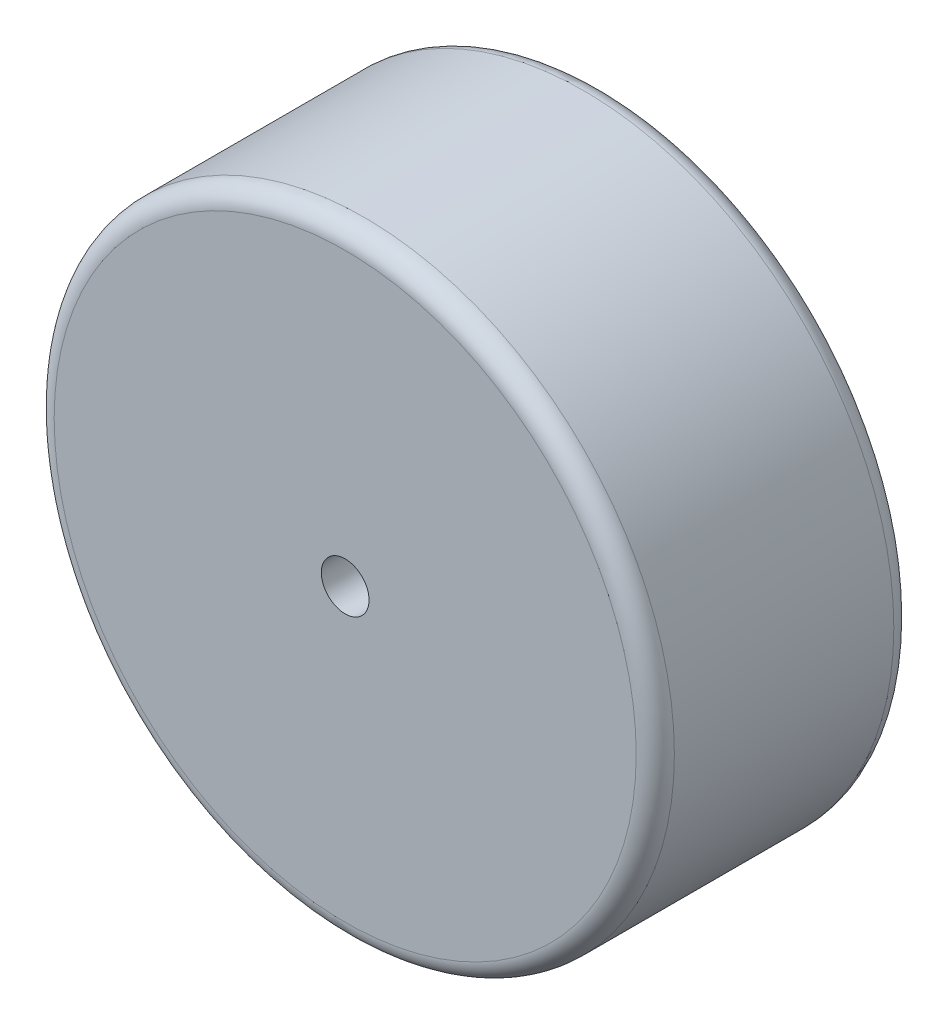
ISO-10303-21;
HEADER;
FILE_DESCRIPTION(('STEP AP214'),'2;1');
FILE_NAME('part.step','',(''),(''),'','','');
FILE_SCHEMA(('AUTOMOTIVE_DESIGN { 1 0 10303 214 1 1 1 1 }'));
ENDSEC;
DATA;
#1=APPLICATION_CONTEXT('core data for automotive mechanical design processes');
#2=APPLICATION_PROTOCOL_DEFINITION('international standard','automotive_design',2000,#1);
#3=PRODUCT_CONTEXT('',#1,'mechanical');
#4=PRODUCT('Part','Part','',(#3));
#5=PRODUCT_RELATED_PRODUCT_CATEGORY('part','',(#4));
#6=PRODUCT_DEFINITION_FORMATION('','',#4);
#7=PRODUCT_DEFINITION_CONTEXT('part definition',#1,'design');
#8=PRODUCT_DEFINITION('design','',#6,#7);
#9=PRODUCT_DEFINITION_SHAPE('','',#8);
#10=(LENGTH_UNIT() NAMED_UNIT(*) SI_UNIT(.MILLI.,.METRE.));
#11=(NAMED_UNIT(*) PLANE_ANGLE_UNIT() SI_UNIT($,.RADIAN.));
#12=(NAMED_UNIT(*) SI_UNIT($,.STERADIAN.) SOLID_ANGLE_UNIT());
#13=UNCERTAINTY_MEASURE_WITH_UNIT(LENGTH_MEASURE(1.E-05),#10,'distance_accuracy_value','');
#14=(GEOMETRIC_REPRESENTATION_CONTEXT(3) GLOBAL_UNCERTAINTY_ASSIGNED_CONTEXT((#13)) GLOBAL_UNIT_ASSIGNED_CONTEXT((#10,
#11,#12)) REPRESENTATION_CONTEXT('',''));
#15=CARTESIAN_POINT('',(0.,0.,0.));
#16=DIRECTION('',(0.,0.,1.));
#17=DIRECTION('',(1.,0.,0.));
#18=AXIS2_PLACEMENT_3D('',#15,#16,#17);
#19=CARTESIAN_POINT('',(0.,0.,13.5));
#20=DIRECTION('',(0.,0.,-1.));
#21=DIRECTION('',(-1.,0.,0.));
#22=AXIS2_PLACEMENT_3D('',#19,#20,#21);
#23=CYLINDRICAL_SURFACE('',#22,32.5);
#24=CARTESIAN_POINT('',(0.,0.,11.5));
#25=DIRECTION('',(0.,0.,1.));
#26=DIRECTION('',(1.,0.,0.));
#27=AXIS2_PLACEMENT_3D('',#24,#25,#26);
#28=CIRCLE('',#27,32.5);
#29=CARTESIAN_POINT('',(32.5,0.,11.5));
#30=VERTEX_POINT('',#29);
#31=EDGE_CURVE('E41',#30,#30,#28,.F.);
#32=ORIENTED_EDGE('',*,*,#31,.T.);
#33=EDGE_LOOP('',(#32));
#34=FACE_BOUND('',#33,.T.);
#35=CARTESIAN_POINT('',(0.,0.,-11.5));
#36=DIRECTION('',(0.,0.,1.));
#37=DIRECTION('',(1.,0.,0.));
#38=AXIS2_PLACEMENT_3D('',#35,#36,#37);
#39=CIRCLE('',#38,32.5);
#40=CARTESIAN_POINT('',(32.5,0.,-11.5));
#41=VERTEX_POINT('',#40);
#42=EDGE_CURVE('E45',#41,#41,#39,.T.);
#43=ORIENTED_EDGE('',*,*,#42,.T.);
#44=EDGE_LOOP('',(#43));
#45=FACE_BOUND('',#44,.T.);
#46=ADVANCED_FACE('F34',(#34,#45),#23,.T.);
#47=CARTESIAN_POINT('',(0.,0.,13.5));
#48=DIRECTION('',(0.,0.,1.));
#49=DIRECTION('',(1.,0.,0.));
#50=AXIS2_PLACEMENT_3D('',#47,#48,#49);
#51=PLANE('',#50);
#52=CARTESIAN_POINT('',(0.,0.,13.5));
#53=DIRECTION('',(0.,0.,1.));
#54=DIRECTION('',(1.,0.,0.));
#55=AXIS2_PLACEMENT_3D('',#52,#53,#54);
#56=CIRCLE('',#55,2.5);
#57=CARTESIAN_POINT('',(2.5,0.,13.5));
#58=VERTEX_POINT('',#57);
#59=EDGE_CURVE('E55',#58,#58,#56,.T.);
#60=ORIENTED_EDGE('',*,*,#59,.F.);
#61=EDGE_LOOP('',(#60));
#62=FACE_BOUND('',#61,.T.);
#63=CARTESIAN_POINT('',(0.,0.,13.5));
#64=DIRECTION('',(0.,0.,1.));
#65=DIRECTION('',(1.,0.,0.));
#66=AXIS2_PLACEMENT_3D('',#63,#64,#65);
#67=CIRCLE('',#66,30.5);
#68=CARTESIAN_POINT('',(30.5,0.,13.5));
#69=VERTEX_POINT('',#68);
#70=EDGE_CURVE('E49',#69,#69,#67,.T.);
#71=ORIENTED_EDGE('',*,*,#70,.T.);
#72=EDGE_LOOP('',(#71));
#73=FACE_BOUND('',#72,.T.);
#74=ADVANCED_FACE('F69',(#62,#73),#51,.T.);
#75=CARTESIAN_POINT('',(0.,0.,-13.5));
#76=DIRECTION('',(0.,0.,1.));
#77=DIRECTION('',(1.,0.,0.));
#78=AXIS2_PLACEMENT_3D('',#75,#76,#77);
#79=PLANE('',#78);
#80=CARTESIAN_POINT('',(0.,0.,-13.5));
#81=DIRECTION('',(0.,0.,1.));
#82=DIRECTION('',(1.,0.,0.));
#83=AXIS2_PLACEMENT_3D('',#80,#81,#82);
#84=CIRCLE('',#83,2.5);
#85=CARTESIAN_POINT('',(2.5,0.,-13.5));
#86=VERTEX_POINT('',#85);
#87=EDGE_CURVE('E54',#86,#86,#84,.T.);
#88=ORIENTED_EDGE('',*,*,#87,.T.);
#89=EDGE_LOOP('',(#88));
#90=FACE_BOUND('',#89,.T.);
#91=CARTESIAN_POINT('',(0.,0.,-13.5));
#92=DIRECTION('',(0.,0.,1.));
#93=DIRECTION('',(1.,0.,0.));
#94=AXIS2_PLACEMENT_3D('',#91,#92,#93);
#95=CIRCLE('',#94,30.5);
#96=CARTESIAN_POINT('',(30.5,0.,-13.5));
#97=VERTEX_POINT('',#96);
#98=EDGE_CURVE('E10',#97,#97,#95,.F.);
#99=ORIENTED_EDGE('',*,*,#98,.T.);
#100=EDGE_LOOP('',(#99));
#101=FACE_BOUND('',#100,.T.);
#102=ADVANCED_FACE('F61',(#90,#101),#79,.F.);
#103=CARTESIAN_POINT('',(0.,0.,11.5));
#104=DIRECTION('',(0.,0.,1.));
#105=DIRECTION('',(1.,0.,0.));
#106=AXIS2_PLACEMENT_3D('',#103,#104,#105);
#107=TOROIDAL_SURFACE('',#106,30.5,2.);
#108=ORIENTED_EDGE('',*,*,#31,.F.);
#109=EDGE_LOOP('',(#108));
#110=FACE_BOUND('',#109,.T.);
#111=ORIENTED_EDGE('',*,*,#70,.F.);
#112=EDGE_LOOP('',(#111));
#113=FACE_BOUND('',#112,.T.);
#114=ADVANCED_FACE('F75',(#110,#113),#107,.T.);
#115=CARTESIAN_POINT('',(0.,0.,-11.5));
#116=DIRECTION('',(0.,0.,1.));
#117=DIRECTION('',(1.,0.,0.));
#118=AXIS2_PLACEMENT_3D('',#115,#116,#117);
#119=TOROIDAL_SURFACE('',#118,30.5,2.);
#120=ORIENTED_EDGE('',*,*,#98,.F.);
#121=EDGE_LOOP('',(#120));
#122=FACE_BOUND('',#121,.T.);
#123=ORIENTED_EDGE('',*,*,#42,.F.);
#124=EDGE_LOOP('',(#123));
#125=FACE_BOUND('',#124,.T.);
#126=ADVANCED_FACE('F36',(#122,#125),#119,.T.);
#127=CARTESIAN_POINT('',(0.,0.,-13.5));
#128=DIRECTION('',(0.,0.,1.));
#129=DIRECTION('',(1.,0.,0.));
#130=AXIS2_PLACEMENT_3D('',#127,#128,#129);
#131=CYLINDRICAL_SURFACE('',#130,2.5);
#132=ORIENTED_EDGE('',*,*,#87,.F.);
#133=EDGE_LOOP('',(#132));
#134=FACE_BOUND('',#133,.T.);
#135=ORIENTED_EDGE('',*,*,#59,.T.);
#136=EDGE_LOOP('',(#135));
#137=FACE_BOUND('',#136,.T.);
#138=ADVANCED_FACE('F63',(#134,#137),#131,.F.);
#139=CLOSED_SHELL('',(#46,#74,#102,#114,#126,#138));
#140=MANIFOLD_SOLID_BREP('B2',#139);
#141=ADVANCED_BREP_SHAPE_REPRESENTATION('',(#18,#140),#14);
#142=SHAPE_DEFINITION_REPRESENTATION(#9,#141);
ENDSEC;
END-ISO-10303-21;
